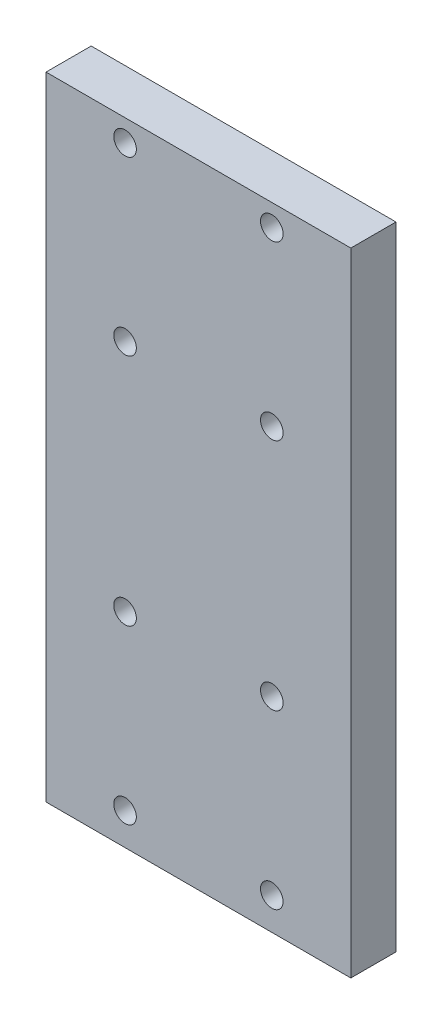
ISO-10303-21;
HEADER;
FILE_DESCRIPTION(('STEP AP214'),'2;1');
FILE_NAME('part.step','',(''),(''),'','','');
FILE_SCHEMA(('AUTOMOTIVE_DESIGN { 1 0 10303 214 1 1 1 1 }'));
ENDSEC;
DATA;
#1=APPLICATION_CONTEXT('core data for automotive mechanical design processes');
#2=APPLICATION_PROTOCOL_DEFINITION('international standard','automotive_design',2000,#1);
#3=PRODUCT_CONTEXT('',#1,'mechanical');
#4=PRODUCT('Part','Part','',(#3));
#5=PRODUCT_RELATED_PRODUCT_CATEGORY('part','',(#4));
#6=PRODUCT_DEFINITION_FORMATION('','',#4);
#7=PRODUCT_DEFINITION_CONTEXT('part definition',#1,'design');
#8=PRODUCT_DEFINITION('design','',#6,#7);
#9=PRODUCT_DEFINITION_SHAPE('','',#8);
#10=(LENGTH_UNIT() NAMED_UNIT(*) SI_UNIT(.MILLI.,.METRE.));
#11=(NAMED_UNIT(*) PLANE_ANGLE_UNIT() SI_UNIT($,.RADIAN.));
#12=(NAMED_UNIT(*) SI_UNIT($,.STERADIAN.) SOLID_ANGLE_UNIT());
#13=UNCERTAINTY_MEASURE_WITH_UNIT(LENGTH_MEASURE(1.E-05),#10,'distance_accuracy_value','');
#14=(GEOMETRIC_REPRESENTATION_CONTEXT(3) GLOBAL_UNCERTAINTY_ASSIGNED_CONTEXT((#13)) GLOBAL_UNIT_ASSIGNED_CONTEXT((#10,
#11,#12)) REPRESENTATION_CONTEXT('',''));
#15=CARTESIAN_POINT('',(0.,0.,0.));
#16=DIRECTION('',(0.,0.,1.));
#17=DIRECTION('',(1.,0.,0.));
#18=AXIS2_PLACEMENT_3D('',#15,#16,#17);
#19=CARTESIAN_POINT('',(0.,0.,8.));
#20=DIRECTION('',(0.,0.,-1.));
#21=DIRECTION('',(-1.,0.,0.));
#22=AXIS2_PLACEMENT_3D('',#19,#20,#21);
#23=PLANE('',#22);
#24=CARTESIAN_POINT('',(-13.,-50.3,8.));
#25=DIRECTION('',(0.,0.,1.));
#26=DIRECTION('',(1.,0.,0.));
#27=AXIS2_PLACEMENT_3D('',#24,#25,#26);
#28=CIRCLE('',#27,2.);
#29=CARTESIAN_POINT('',(-11.,-50.3,8.));
#30=VERTEX_POINT('',#29);
#31=EDGE_CURVE('E154',#30,#30,#28,.T.);
#32=ORIENTED_EDGE('',*,*,#31,.F.);
#33=EDGE_LOOP('',(#32));
#34=FACE_BOUND('',#33,.T.);
#35=CARTESIAN_POINT('',(13.,-19.8,8.));
#36=DIRECTION('',(0.,0.,1.));
#37=DIRECTION('',(1.,0.,0.));
#38=AXIS2_PLACEMENT_3D('',#35,#36,#37);
#39=CIRCLE('',#38,2.);
#40=CARTESIAN_POINT('',(15.,-19.8,8.));
#41=VERTEX_POINT('',#40);
#42=EDGE_CURVE('E142',#41,#41,#39,.T.);
#43=ORIENTED_EDGE('',*,*,#42,.F.);
#44=EDGE_LOOP('',(#43));
#45=FACE_BOUND('',#44,.T.);
#46=CARTESIAN_POINT('',(13.,21.64,8.));
#47=DIRECTION('',(0.,0.,1.));
#48=DIRECTION('',(1.,0.,0.));
#49=AXIS2_PLACEMENT_3D('',#46,#47,#48);
#50=CIRCLE('',#49,2.);
#51=CARTESIAN_POINT('',(15.,21.64,8.));
#52=VERTEX_POINT('',#51);
#53=EDGE_CURVE('E130',#52,#52,#50,.T.);
#54=ORIENTED_EDGE('',*,*,#53,.F.);
#55=EDGE_LOOP('',(#54));
#56=FACE_BOUND('',#55,.T.);
#57=CARTESIAN_POINT('',(-13.,52.14,8.));
#58=DIRECTION('',(0.,0.,1.));
#59=DIRECTION('',(1.,0.,0.));
#60=AXIS2_PLACEMENT_3D('',#57,#58,#59);
#61=CIRCLE('',#60,2.);
#62=CARTESIAN_POINT('',(-11.,52.14,8.));
#63=VERTEX_POINT('',#62);
#64=EDGE_CURVE('E109',#63,#63,#61,.T.);
#65=ORIENTED_EDGE('',*,*,#64,.F.);
#66=EDGE_LOOP('',(#65));
#67=FACE_BOUND('',#66,.T.);
#68=DIRECTION('',(0.,1.,0.));
#69=VECTOR('',#68,1.);
#70=CARTESIAN_POINT('',(27.,-56.,8.));
#71=LINE('',#70,#69);
#72=CARTESIAN_POINT('',(27.,-56.,8.));
#73=VERTEX_POINT('',#72);
#74=CARTESIAN_POINT('',(27.,56.,8.));
#75=VERTEX_POINT('',#74);
#76=EDGE_CURVE('E94',#73,#75,#71,.T.);
#77=ORIENTED_EDGE('',*,*,#76,.T.);
#78=DIRECTION('',(-1.,0.,0.));
#79=VECTOR('',#78,1.);
#80=CARTESIAN_POINT('',(-27.,56.,8.));
#81=LINE('',#80,#79);
#82=CARTESIAN_POINT('',(-27.,56.,8.));
#83=VERTEX_POINT('',#82);
#84=EDGE_CURVE('E89',#75,#83,#81,.T.);
#85=ORIENTED_EDGE('',*,*,#84,.T.);
#86=DIRECTION('',(0.,-1.,0.));
#87=VECTOR('',#86,1.);
#88=CARTESIAN_POINT('',(-27.,-56.,8.));
#89=LINE('',#88,#87);
#90=CARTESIAN_POINT('',(-27.,-56.,8.));
#91=VERTEX_POINT('',#90);
#92=EDGE_CURVE('E92',#83,#91,#89,.T.);
#93=ORIENTED_EDGE('',*,*,#92,.T.);
#94=DIRECTION('',(1.,0.,0.));
#95=VECTOR('',#94,1.);
#96=CARTESIAN_POINT('',(-27.,-56.,8.));
#97=LINE('',#96,#95);
#98=EDGE_CURVE('E59',#91,#73,#97,.T.);
#99=ORIENTED_EDGE('',*,*,#98,.T.);
#100=EDGE_LOOP('',(#77,#85,#93,#99));
#101=FACE_BOUND('',#100,.T.);
#102=CARTESIAN_POINT('',(13.,52.14,8.));
#103=DIRECTION('',(0.,0.,1.));
#104=DIRECTION('',(1.,0.,0.));
#105=AXIS2_PLACEMENT_3D('',#102,#103,#104);
#106=CIRCLE('',#105,2.);
#107=CARTESIAN_POINT('',(15.,52.14,8.));
#108=VERTEX_POINT('',#107);
#109=EDGE_CURVE('E124',#108,#108,#106,.T.);
#110=ORIENTED_EDGE('',*,*,#109,.F.);
#111=EDGE_LOOP('',(#110));
#112=FACE_BOUND('',#111,.T.);
#113=CARTESIAN_POINT('',(-13.,21.64,8.));
#114=DIRECTION('',(0.,0.,1.));
#115=DIRECTION('',(1.,0.,0.));
#116=AXIS2_PLACEMENT_3D('',#113,#114,#115);
#117=CIRCLE('',#116,2.);
#118=CARTESIAN_POINT('',(-11.,21.64,8.));
#119=VERTEX_POINT('',#118);
#120=EDGE_CURVE('E136',#119,#119,#117,.T.);
#121=ORIENTED_EDGE('',*,*,#120,.F.);
#122=EDGE_LOOP('',(#121));
#123=FACE_BOUND('',#122,.T.);
#124=CARTESIAN_POINT('',(-13.,-19.8,8.));
#125=DIRECTION('',(0.,0.,1.));
#126=DIRECTION('',(1.,0.,0.));
#127=AXIS2_PLACEMENT_3D('',#124,#125,#126);
#128=CIRCLE('',#127,2.);
#129=CARTESIAN_POINT('',(-11.,-19.8,8.));
#130=VERTEX_POINT('',#129);
#131=EDGE_CURVE('E148',#130,#130,#128,.T.);
#132=ORIENTED_EDGE('',*,*,#131,.F.);
#133=EDGE_LOOP('',(#132));
#134=FACE_BOUND('',#133,.T.);
#135=CARTESIAN_POINT('',(13.,-50.3,8.));
#136=DIRECTION('',(0.,0.,1.));
#137=DIRECTION('',(1.,0.,0.));
#138=AXIS2_PLACEMENT_3D('',#135,#136,#137);
#139=CIRCLE('',#138,2.);
#140=CARTESIAN_POINT('',(15.,-50.3,8.));
#141=VERTEX_POINT('',#140);
#142=EDGE_CURVE('E160',#141,#141,#139,.T.);
#143=ORIENTED_EDGE('',*,*,#142,.F.);
#144=EDGE_LOOP('',(#143));
#145=FACE_BOUND('',#144,.T.);
#146=ADVANCED_FACE('F42',(#34,#45,#56,#67,#101,#112,#123,#134,#145),#23,.F.);
#147=CARTESIAN_POINT('',(0.,0.,0.));
#148=DIRECTION('',(0.,0.,-1.));
#149=DIRECTION('',(-1.,0.,0.));
#150=AXIS2_PLACEMENT_3D('',#147,#148,#149);
#151=PLANE('',#150);
#152=CARTESIAN_POINT('',(-13.,-50.3,0.));
#153=DIRECTION('',(0.,0.,1.));
#154=DIRECTION('',(1.,0.,0.));
#155=AXIS2_PLACEMENT_3D('',#152,#153,#154);
#156=CIRCLE('',#155,2.);
#157=CARTESIAN_POINT('',(-11.,-50.3,0.));
#158=VERTEX_POINT('',#157);
#159=EDGE_CURVE('E157',#158,#158,#156,.T.);
#160=ORIENTED_EDGE('',*,*,#159,.T.);
#161=EDGE_LOOP('',(#160));
#162=FACE_BOUND('',#161,.T.);
#163=CARTESIAN_POINT('',(13.,-19.8,0.));
#164=DIRECTION('',(0.,0.,1.));
#165=DIRECTION('',(1.,0.,0.));
#166=AXIS2_PLACEMENT_3D('',#163,#164,#165);
#167=CIRCLE('',#166,2.);
#168=CARTESIAN_POINT('',(15.,-19.8,0.));
#169=VERTEX_POINT('',#168);
#170=EDGE_CURVE('E145',#169,#169,#167,.T.);
#171=ORIENTED_EDGE('',*,*,#170,.T.);
#172=EDGE_LOOP('',(#171));
#173=FACE_BOUND('',#172,.T.);
#174=CARTESIAN_POINT('',(13.,21.64,0.));
#175=DIRECTION('',(0.,0.,1.));
#176=DIRECTION('',(1.,0.,0.));
#177=AXIS2_PLACEMENT_3D('',#174,#175,#176);
#178=CIRCLE('',#177,2.);
#179=CARTESIAN_POINT('',(15.,21.64,0.));
#180=VERTEX_POINT('',#179);
#181=EDGE_CURVE('E133',#180,#180,#178,.T.);
#182=ORIENTED_EDGE('',*,*,#181,.T.);
#183=EDGE_LOOP('',(#182));
#184=FACE_BOUND('',#183,.T.);
#185=CARTESIAN_POINT('',(-13.,52.14,0.));
#186=DIRECTION('',(0.,0.,1.));
#187=DIRECTION('',(1.,0.,0.));
#188=AXIS2_PLACEMENT_3D('',#185,#186,#187);
#189=CIRCLE('',#188,2.);
#190=CARTESIAN_POINT('',(-11.,52.14,0.));
#191=VERTEX_POINT('',#190);
#192=EDGE_CURVE('E121',#191,#191,#189,.T.);
#193=ORIENTED_EDGE('',*,*,#192,.T.);
#194=EDGE_LOOP('',(#193));
#195=FACE_BOUND('',#194,.T.);
#196=DIRECTION('',(0.,1.,0.));
#197=VECTOR('',#196,1.);
#198=CARTESIAN_POINT('',(27.,-56.,0.));
#199=LINE('',#198,#197);
#200=CARTESIAN_POINT('',(27.,-56.,0.));
#201=VERTEX_POINT('',#200);
#202=CARTESIAN_POINT('',(27.,56.,0.));
#203=VERTEX_POINT('',#202);
#204=EDGE_CURVE('E106',#201,#203,#199,.T.);
#205=ORIENTED_EDGE('',*,*,#204,.F.);
#206=DIRECTION('',(1.,0.,0.));
#207=VECTOR('',#206,1.);
#208=CARTESIAN_POINT('',(-27.,-56.,0.));
#209=LINE('',#208,#207);
#210=CARTESIAN_POINT('',(-27.,-56.,0.));
#211=VERTEX_POINT('',#210);
#212=EDGE_CURVE('E82',#211,#201,#209,.T.);
#213=ORIENTED_EDGE('',*,*,#212,.F.);
#214=DIRECTION('',(0.,-1.,0.));
#215=VECTOR('',#214,1.);
#216=CARTESIAN_POINT('',(-27.,-56.,0.));
#217=LINE('',#216,#215);
#218=CARTESIAN_POINT('',(-27.,56.,0.));
#219=VERTEX_POINT('',#218);
#220=EDGE_CURVE('E76',#219,#211,#217,.T.);
#221=ORIENTED_EDGE('',*,*,#220,.F.);
#222=DIRECTION('',(-1.,0.,0.));
#223=VECTOR('',#222,1.);
#224=CARTESIAN_POINT('',(-27.,56.,0.));
#225=LINE('',#224,#223);
#226=EDGE_CURVE('E98',#203,#219,#225,.T.);
#227=ORIENTED_EDGE('',*,*,#226,.F.);
#228=EDGE_LOOP('',(#205,#213,#221,#227));
#229=FACE_BOUND('',#228,.T.);
#230=CARTESIAN_POINT('',(13.,52.14,0.));
#231=DIRECTION('',(0.,0.,1.));
#232=DIRECTION('',(1.,0.,0.));
#233=AXIS2_PLACEMENT_3D('',#230,#231,#232);
#234=CIRCLE('',#233,2.);
#235=CARTESIAN_POINT('',(15.,52.14,0.));
#236=VERTEX_POINT('',#235);
#237=EDGE_CURVE('E127',#236,#236,#234,.T.);
#238=ORIENTED_EDGE('',*,*,#237,.T.);
#239=EDGE_LOOP('',(#238));
#240=FACE_BOUND('',#239,.T.);
#241=CARTESIAN_POINT('',(-13.,21.64,0.));
#242=DIRECTION('',(0.,0.,1.));
#243=DIRECTION('',(1.,0.,0.));
#244=AXIS2_PLACEMENT_3D('',#241,#242,#243);
#245=CIRCLE('',#244,2.);
#246=CARTESIAN_POINT('',(-11.,21.64,0.));
#247=VERTEX_POINT('',#246);
#248=EDGE_CURVE('E139',#247,#247,#245,.T.);
#249=ORIENTED_EDGE('',*,*,#248,.T.);
#250=EDGE_LOOP('',(#249));
#251=FACE_BOUND('',#250,.T.);
#252=CARTESIAN_POINT('',(-13.,-19.8,0.));
#253=DIRECTION('',(0.,0.,1.));
#254=DIRECTION('',(1.,0.,0.));
#255=AXIS2_PLACEMENT_3D('',#252,#253,#254);
#256=CIRCLE('',#255,2.);
#257=CARTESIAN_POINT('',(-11.,-19.8,0.));
#258=VERTEX_POINT('',#257);
#259=EDGE_CURVE('E151',#258,#258,#256,.T.);
#260=ORIENTED_EDGE('',*,*,#259,.T.);
#261=EDGE_LOOP('',(#260));
#262=FACE_BOUND('',#261,.T.);
#263=CARTESIAN_POINT('',(13.,-50.3,0.));
#264=DIRECTION('',(0.,0.,1.));
#265=DIRECTION('',(1.,0.,0.));
#266=AXIS2_PLACEMENT_3D('',#263,#264,#265);
#267=CIRCLE('',#266,2.);
#268=CARTESIAN_POINT('',(15.,-50.3,0.));
#269=VERTEX_POINT('',#268);
#270=EDGE_CURVE('E163',#269,#269,#267,.T.);
#271=ORIENTED_EDGE('',*,*,#270,.T.);
#272=EDGE_LOOP('',(#271));
#273=FACE_BOUND('',#272,.T.);
#274=ADVANCED_FACE('F117',(#162,#173,#184,#195,#229,#240,#251,#262,#273),#151,.T.);
#275=CARTESIAN_POINT('',(27.,-56.,8.));
#276=DIRECTION('',(-1.,0.,0.));
#277=DIRECTION('',(0.,-1.,0.));
#278=AXIS2_PLACEMENT_3D('',#275,#276,#277);
#279=PLANE('',#278);
#280=ORIENTED_EDGE('',*,*,#204,.T.);
#281=DIRECTION('',(0.,0.,-1.));
#282=VECTOR('',#281,1.);
#283=CARTESIAN_POINT('',(27.,56.,8.));
#284=LINE('',#283,#282);
#285=EDGE_CURVE('E13',#75,#203,#284,.T.);
#286=ORIENTED_EDGE('',*,*,#285,.F.);
#287=ORIENTED_EDGE('',*,*,#76,.F.);
#288=DIRECTION('',(0.,0.,-1.));
#289=VECTOR('',#288,1.);
#290=CARTESIAN_POINT('',(27.,-56.,8.));
#291=LINE('',#290,#289);
#292=EDGE_CURVE('E102',#73,#201,#291,.T.);
#293=ORIENTED_EDGE('',*,*,#292,.T.);
#294=EDGE_LOOP('',(#280,#286,#287,#293));
#295=FACE_BOUND('',#294,.T.);
#296=ADVANCED_FACE('F44',(#295),#279,.F.);
#297=CARTESIAN_POINT('',(-27.,56.,8.));
#298=DIRECTION('',(0.,-1.,0.));
#299=DIRECTION('',(1.,0.,0.));
#300=AXIS2_PLACEMENT_3D('',#297,#298,#299);
#301=PLANE('',#300);
#302=ORIENTED_EDGE('',*,*,#226,.T.);
#303=DIRECTION('',(0.,0.,-1.));
#304=VECTOR('',#303,1.);
#305=CARTESIAN_POINT('',(-27.,56.,8.));
#306=LINE('',#305,#304);
#307=EDGE_CURVE('E51',#83,#219,#306,.T.);
#308=ORIENTED_EDGE('',*,*,#307,.F.);
#309=ORIENTED_EDGE('',*,*,#84,.F.);
#310=ORIENTED_EDGE('',*,*,#285,.T.);
#311=EDGE_LOOP('',(#302,#308,#309,#310));
#312=FACE_BOUND('',#311,.T.);
#313=ADVANCED_FACE('F97',(#312),#301,.F.);
#314=CARTESIAN_POINT('',(-27.,-56.,8.));
#315=DIRECTION('',(1.,0.,0.));
#316=DIRECTION('',(0.,0.,-1.));
#317=AXIS2_PLACEMENT_3D('',#314,#315,#316);
#318=PLANE('',#317);
#319=ORIENTED_EDGE('',*,*,#220,.T.);
#320=DIRECTION('',(0.,0.,-1.));
#321=VECTOR('',#320,1.);
#322=CARTESIAN_POINT('',(-27.,-56.,8.));
#323=LINE('',#322,#321);
#324=EDGE_CURVE('E99',#91,#211,#323,.T.);
#325=ORIENTED_EDGE('',*,*,#324,.F.);
#326=ORIENTED_EDGE('',*,*,#92,.F.);
#327=ORIENTED_EDGE('',*,*,#307,.T.);
#328=EDGE_LOOP('',(#319,#325,#326,#327));
#329=FACE_BOUND('',#328,.T.);
#330=ADVANCED_FACE('F100',(#329),#318,.F.);
#331=CARTESIAN_POINT('',(-27.,-56.,8.));
#332=DIRECTION('',(0.,1.,0.));
#333=DIRECTION('',(-1.,0.,0.));
#334=AXIS2_PLACEMENT_3D('',#331,#332,#333);
#335=PLANE('',#334);
#336=ORIENTED_EDGE('',*,*,#212,.T.);
#337=ORIENTED_EDGE('',*,*,#292,.F.);
#338=ORIENTED_EDGE('',*,*,#98,.F.);
#339=ORIENTED_EDGE('',*,*,#324,.T.);
#340=EDGE_LOOP('',(#336,#337,#338,#339));
#341=FACE_BOUND('',#340,.T.);
#342=ADVANCED_FACE('F114',(#341),#335,.F.);
#343=CARTESIAN_POINT('',(-13.,52.14,8.));
#344=DIRECTION('',(0.,0.,-1.));
#345=DIRECTION('',(-1.,0.,0.));
#346=AXIS2_PLACEMENT_3D('',#343,#344,#345);
#347=CYLINDRICAL_SURFACE('',#346,2.);
#348=ORIENTED_EDGE('',*,*,#64,.T.);
#349=EDGE_LOOP('',(#348));
#350=FACE_BOUND('',#349,.T.);
#351=ORIENTED_EDGE('',*,*,#192,.F.);
#352=EDGE_LOOP('',(#351));
#353=FACE_BOUND('',#352,.T.);
#354=ADVANCED_FACE('F183',(#350,#353),#347,.F.);
#355=CARTESIAN_POINT('',(13.,52.14,8.));
#356=DIRECTION('',(0.,0.,-1.));
#357=DIRECTION('',(-1.,0.,0.));
#358=AXIS2_PLACEMENT_3D('',#355,#356,#357);
#359=CYLINDRICAL_SURFACE('',#358,2.);
#360=ORIENTED_EDGE('',*,*,#109,.T.);
#361=EDGE_LOOP('',(#360));
#362=FACE_BOUND('',#361,.T.);
#363=ORIENTED_EDGE('',*,*,#237,.F.);
#364=EDGE_LOOP('',(#363));
#365=FACE_BOUND('',#364,.T.);
#366=ADVANCED_FACE('F229',(#362,#365),#359,.F.);
#367=CARTESIAN_POINT('',(13.,21.64,8.));
#368=DIRECTION('',(0.,0.,-1.));
#369=DIRECTION('',(-1.,0.,0.));
#370=AXIS2_PLACEMENT_3D('',#367,#368,#369);
#371=CYLINDRICAL_SURFACE('',#370,2.);
#372=ORIENTED_EDGE('',*,*,#53,.T.);
#373=EDGE_LOOP('',(#372));
#374=FACE_BOUND('',#373,.T.);
#375=ORIENTED_EDGE('',*,*,#181,.F.);
#376=EDGE_LOOP('',(#375));
#377=FACE_BOUND('',#376,.T.);
#378=ADVANCED_FACE('F237',(#374,#377),#371,.F.);
#379=CARTESIAN_POINT('',(-13.,21.64,8.));
#380=DIRECTION('',(0.,0.,-1.));
#381=DIRECTION('',(-1.,0.,0.));
#382=AXIS2_PLACEMENT_3D('',#379,#380,#381);
#383=CYLINDRICAL_SURFACE('',#382,2.);
#384=ORIENTED_EDGE('',*,*,#120,.T.);
#385=EDGE_LOOP('',(#384));
#386=FACE_BOUND('',#385,.T.);
#387=ORIENTED_EDGE('',*,*,#248,.F.);
#388=EDGE_LOOP('',(#387));
#389=FACE_BOUND('',#388,.T.);
#390=ADVANCED_FACE('F245',(#386,#389),#383,.F.);
#391=CARTESIAN_POINT('',(13.,-19.8,8.));
#392=DIRECTION('',(0.,0.,-1.));
#393=DIRECTION('',(-1.,0.,0.));
#394=AXIS2_PLACEMENT_3D('',#391,#392,#393);
#395=CYLINDRICAL_SURFACE('',#394,2.);
#396=ORIENTED_EDGE('',*,*,#42,.T.);
#397=EDGE_LOOP('',(#396));
#398=FACE_BOUND('',#397,.T.);
#399=ORIENTED_EDGE('',*,*,#170,.F.);
#400=EDGE_LOOP('',(#399));
#401=FACE_BOUND('',#400,.T.);
#402=ADVANCED_FACE('F254',(#398,#401),#395,.F.);
#403=CARTESIAN_POINT('',(-13.,-19.8,8.));
#404=DIRECTION('',(0.,0.,-1.));
#405=DIRECTION('',(-1.,0.,0.));
#406=AXIS2_PLACEMENT_3D('',#403,#404,#405);
#407=CYLINDRICAL_SURFACE('',#406,2.);
#408=ORIENTED_EDGE('',*,*,#131,.T.);
#409=EDGE_LOOP('',(#408));
#410=FACE_BOUND('',#409,.T.);
#411=ORIENTED_EDGE('',*,*,#259,.F.);
#412=EDGE_LOOP('',(#411));
#413=FACE_BOUND('',#412,.T.);
#414=ADVANCED_FACE('F263',(#410,#413),#407,.F.);
#415=CARTESIAN_POINT('',(-13.,-50.3,8.));
#416=DIRECTION('',(0.,0.,-1.));
#417=DIRECTION('',(-1.,0.,0.));
#418=AXIS2_PLACEMENT_3D('',#415,#416,#417);
#419=CYLINDRICAL_SURFACE('',#418,2.);
#420=ORIENTED_EDGE('',*,*,#31,.T.);
#421=EDGE_LOOP('',(#420));
#422=FACE_BOUND('',#421,.T.);
#423=ORIENTED_EDGE('',*,*,#159,.F.);
#424=EDGE_LOOP('',(#423));
#425=FACE_BOUND('',#424,.T.);
#426=ADVANCED_FACE('F272',(#422,#425),#419,.F.);
#427=CARTESIAN_POINT('',(13.,-50.3,8.));
#428=DIRECTION('',(0.,0.,-1.));
#429=DIRECTION('',(-1.,0.,0.));
#430=AXIS2_PLACEMENT_3D('',#427,#428,#429);
#431=CYLINDRICAL_SURFACE('',#430,2.);
#432=ORIENTED_EDGE('',*,*,#142,.T.);
#433=EDGE_LOOP('',(#432));
#434=FACE_BOUND('',#433,.T.);
#435=ORIENTED_EDGE('',*,*,#270,.F.);
#436=EDGE_LOOP('',(#435));
#437=FACE_BOUND('',#436,.T.);
#438=ADVANCED_FACE('F169',(#434,#437),#431,.F.);
#439=CLOSED_SHELL('',(#146,#274,#296,#313,#330,#342,#354,#366,#378,#390,#402,#414,#426,#438));
#440=MANIFOLD_SOLID_BREP('B2',#439);
#441=ADVANCED_BREP_SHAPE_REPRESENTATION('',(#18,#440),#14);
#442=SHAPE_DEFINITION_REPRESENTATION(#9,#441);
ENDSEC;
END-ISO-10303-21;
